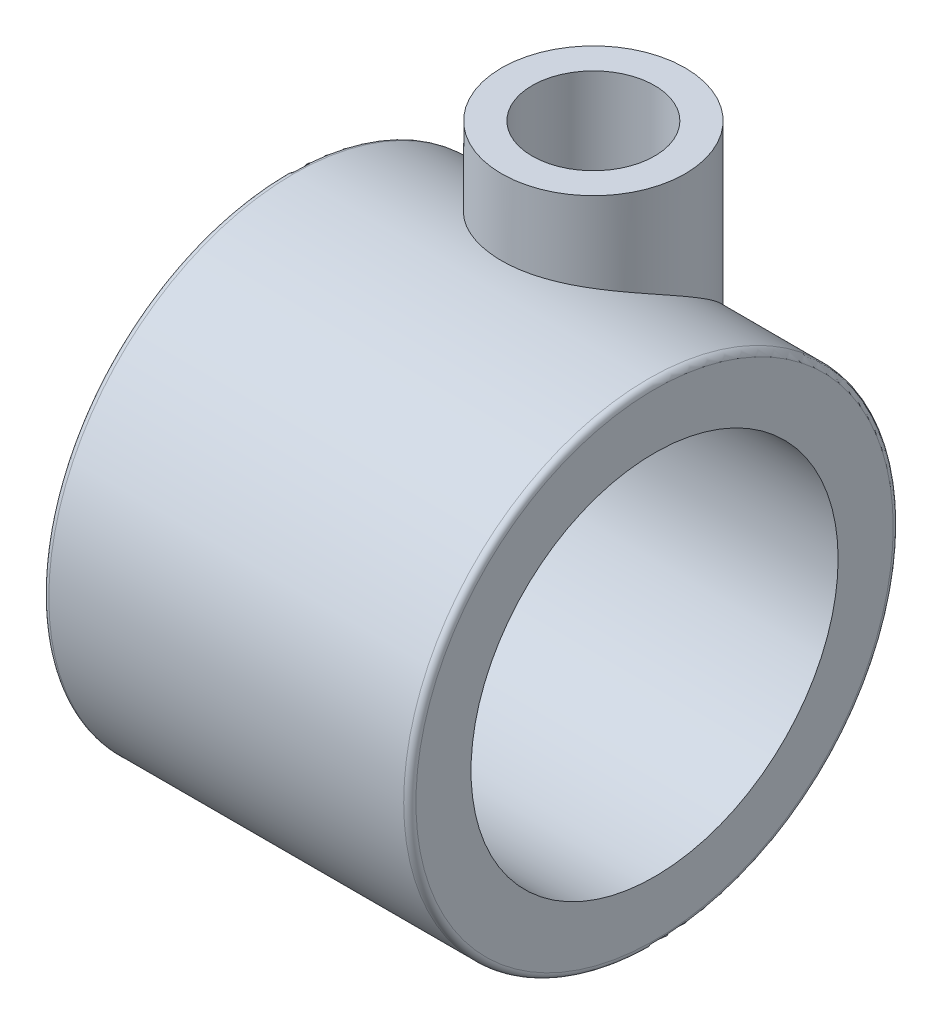
ISO-10303-21;
HEADER;
FILE_DESCRIPTION(('STEP AP214'),'2;1');
FILE_NAME('part.step','',(''),(''),'','','');
FILE_SCHEMA(('AUTOMOTIVE_DESIGN { 1 0 10303 214 1 1 1 1 }'));
ENDSEC;
DATA;
#1=APPLICATION_CONTEXT('core data for automotive mechanical design processes');
#2=APPLICATION_PROTOCOL_DEFINITION('international standard','automotive_design',2000,#1);
#3=PRODUCT_CONTEXT('',#1,'mechanical');
#4=PRODUCT('Part','Part','',(#3));
#5=PRODUCT_RELATED_PRODUCT_CATEGORY('part','',(#4));
#6=PRODUCT_DEFINITION_FORMATION('','',#4);
#7=PRODUCT_DEFINITION_CONTEXT('part definition',#1,'design');
#8=PRODUCT_DEFINITION('design','',#6,#7);
#9=PRODUCT_DEFINITION_SHAPE('','',#8);
#10=(LENGTH_UNIT() NAMED_UNIT(*) SI_UNIT(.MILLI.,.METRE.));
#11=(NAMED_UNIT(*) PLANE_ANGLE_UNIT() SI_UNIT($,.RADIAN.));
#12=(NAMED_UNIT(*) SI_UNIT($,.STERADIAN.) SOLID_ANGLE_UNIT());
#13=UNCERTAINTY_MEASURE_WITH_UNIT(LENGTH_MEASURE(1.E-05),#10,'distance_accuracy_value','');
#14=(GEOMETRIC_REPRESENTATION_CONTEXT(3) GLOBAL_UNCERTAINTY_ASSIGNED_CONTEXT((#13)) GLOBAL_UNIT_ASSIGNED_CONTEXT((#10,
#11,#12)) REPRESENTATION_CONTEXT('',''));
#15=CARTESIAN_POINT('',(0.,0.,0.));
#16=DIRECTION('',(0.,0.,1.));
#17=DIRECTION('',(1.,0.,0.));
#18=AXIS2_PLACEMENT_3D('',#15,#16,#17);
#19=CARTESIAN_POINT('',(30.,0.,0.));
#20=DIRECTION('',(-1.,0.,0.));
#21=DIRECTION('',(0.,0.,1.));
#22=AXIS2_PLACEMENT_3D('',#19,#20,#21);
#23=CYLINDRICAL_SURFACE('',#22,15.);
#24=CARTESIAN_POINT('',(0.,0.,0.));
#25=DIRECTION('',(1.,0.,0.));
#26=DIRECTION('',(0.,0.,-1.));
#27=AXIS2_PLACEMENT_3D('',#24,#25,#26);
#28=CIRCLE('',#27,15.);
#29=CARTESIAN_POINT('',(0.,0.,-15.));
#30=VERTEX_POINT('',#29);
#31=EDGE_CURVE('E57',#30,#30,#28,.T.);
#32=ORIENTED_EDGE('',*,*,#31,.F.);
#33=EDGE_LOOP('',(#32));
#34=FACE_BOUND('',#33,.T.);
#35=CARTESIAN_POINT('',(30.,0.,0.));
#36=DIRECTION('',(1.,0.,0.));
#37=DIRECTION('',(0.,0.,-1.));
#38=AXIS2_PLACEMENT_3D('',#35,#36,#37);
#39=CIRCLE('',#38,15.);
#40=CARTESIAN_POINT('',(30.,0.,-15.));
#41=VERTEX_POINT('',#40);
#42=EDGE_CURVE('E60',#41,#41,#39,.T.);
#43=ORIENTED_EDGE('',*,*,#42,.T.);
#44=EDGE_LOOP('',(#43));
#45=FACE_BOUND('',#44,.T.);
#46=ADVANCED_FACE('F36',(#34,#45),#23,.F.);
#47=CARTESIAN_POINT('',(30.,0.,0.));
#48=DIRECTION('',(1.,0.,0.));
#49=DIRECTION('',(0.,0.,-1.));
#50=AXIS2_PLACEMENT_3D('',#47,#48,#49);
#51=PLANE('',#50);
#52=CARTESIAN_POINT('',(30.,0.,0.));
#53=DIRECTION('',(1.,0.,0.));
#54=DIRECTION('',(0.,0.,-1.));
#55=AXIS2_PLACEMENT_3D('',#52,#53,#54);
#56=CIRCLE('',#55,19.5);
#57=CARTESIAN_POINT('',(30.,0.,-19.5));
#58=VERTEX_POINT('',#57);
#59=EDGE_CURVE('E51',#58,#58,#56,.T.);
#60=ORIENTED_EDGE('',*,*,#59,.T.);
#61=EDGE_LOOP('',(#60));
#62=FACE_BOUND('',#61,.T.);
#63=ORIENTED_EDGE('',*,*,#42,.F.);
#64=EDGE_LOOP('',(#63));
#65=FACE_BOUND('',#64,.T.);
#66=ADVANCED_FACE('F85',(#62,#65),#51,.T.);
#67=CARTESIAN_POINT('',(0.,0.,0.));
#68=DIRECTION('',(1.,0.,0.));
#69=DIRECTION('',(0.,0.,-1.));
#70=AXIS2_PLACEMENT_3D('',#67,#68,#69);
#71=PLANE('',#70);
#72=CARTESIAN_POINT('',(0.,0.,0.));
#73=DIRECTION('',(1.,0.,0.));
#74=DIRECTION('',(0.,0.,-1.));
#75=AXIS2_PLACEMENT_3D('',#72,#73,#74);
#76=CIRCLE('',#75,19.5);
#77=CARTESIAN_POINT('',(0.,0.,-19.5));
#78=VERTEX_POINT('',#77);
#79=EDGE_CURVE('E10',#78,#78,#76,.F.);
#80=ORIENTED_EDGE('',*,*,#79,.T.);
#81=EDGE_LOOP('',(#80));
#82=FACE_BOUND('',#81,.T.);
#83=ORIENTED_EDGE('',*,*,#31,.T.);
#84=EDGE_LOOP('',(#83));
#85=FACE_BOUND('',#84,.T.);
#86=ADVANCED_FACE('F88',(#82,#85),#71,.F.);
#87=CARTESIAN_POINT('',(30.,0.,0.));
#88=DIRECTION('',(-1.,0.,0.));
#89=DIRECTION('',(0.,0.,1.));
#90=AXIS2_PLACEMENT_3D('',#87,#88,#89);
#91=CYLINDRICAL_SURFACE('',#90,20.);
#92=CARTESIAN_POINT('',(29.5,0.,0.));
#93=DIRECTION('',(1.,0.,0.));
#94=DIRECTION('',(0.,0.,-1.));
#95=AXIS2_PLACEMENT_3D('',#92,#93,#94);
#96=CIRCLE('',#95,20.);
#97=CARTESIAN_POINT('',(29.5,0.,-20.));
#98=VERTEX_POINT('',#97);
#99=EDGE_CURVE('E43',#98,#98,#96,.F.);
#100=ORIENTED_EDGE('',*,*,#99,.T.);
#101=EDGE_LOOP('',(#100));
#102=FACE_BOUND('',#101,.T.);
#103=CARTESIAN_POINT('',(0.5,0.,0.));
#104=DIRECTION('',(1.,0.,0.));
#105=DIRECTION('',(0.,0.,-1.));
#106=AXIS2_PLACEMENT_3D('',#103,#104,#105);
#107=CIRCLE('',#106,20.);
#108=CARTESIAN_POINT('',(0.5,0.,-20.));
#109=VERTEX_POINT('',#108);
#110=EDGE_CURVE('E47',#109,#109,#107,.T.);
#111=ORIENTED_EDGE('',*,*,#110,.T.);
#112=EDGE_LOOP('',(#111));
#113=FACE_BOUND('',#112,.T.);
#114=CARTESIAN_POINT('',(15.,9.68245836551854,-17.5));
#115=CARTESIAN_POINT('',(14.8858939543935,9.68246038812694,-17.4999991516018));
#116=CARTESIAN_POINT('',(14.7717691684201,9.68718254641463,-17.4973887566704));
#117=CARTESIAN_POINT('',(14.5444755456601,9.70588856576061,-17.4870190968777));
#118=CARTESIAN_POINT('',(14.4313072513703,9.71987736672575,-17.4792570857636));
#119=CARTESIAN_POINT('',(14.2066386424844,9.75661871880203,-17.458775203148));
#120=CARTESIAN_POINT('',(14.0951420721052,9.77938855886944,-17.4460455502813));
#121=CARTESIAN_POINT('',(13.8746826816451,9.83291609054082,-17.4159323962588));
#122=CARTESIAN_POINT('',(13.765721385415,9.86367845755435,-17.3985461709512));
#123=CARTESIAN_POINT('',(13.5162712608649,9.94331815944179,-17.3531882346049));
#124=CARTESIAN_POINT('',(13.3769176278018,9.99483940684675,-17.3236105058938));
#125=CARTESIAN_POINT('',(13.1040155443049,10.1081275738057,-17.2577532406532));
#126=CARTESIAN_POINT('',(12.9704722707298,10.1699034031473,-17.2214678729872));
#127=CARTESIAN_POINT('',(12.7091421640422,10.3018362491369,-17.1428723011975));
#128=CARTESIAN_POINT('',(12.5813665334741,10.3720086848123,-17.1005509848069));
#129=CARTESIAN_POINT('',(12.3317270173929,10.5189529413566,-17.0105575040081));
#130=CARTESIAN_POINT('',(12.2098616250625,10.5957230661586,-16.9628867138306));
#131=CARTESIAN_POINT('',(11.8849842143306,10.8123205125167,-16.8261685991519));
#132=CARTESIAN_POINT('',(11.6874818571222,10.9573677007991,-16.7322632432396));
#133=CARTESIAN_POINT('',(11.3074827704613,11.2578720824918,-16.5315778083311));
#134=CARTESIAN_POINT('',(11.1249969589164,11.4133367035658,-16.4247884986579));
#135=CARTESIAN_POINT('',(10.7734159445365,11.731369806005,-16.1991683544922));
#136=CARTESIAN_POINT('',(10.6043494999308,11.893952443834,-16.0803128403736));
#137=CARTESIAN_POINT('',(10.2791462804009,12.223290004439,-15.8314188061957));
#138=CARTESIAN_POINT('',(10.1230074601224,12.3900442617417,-15.7013820618459));
#139=CARTESIAN_POINT('',(9.76996922218353,12.7852590053141,-15.3825348915466));
#140=CARTESIAN_POINT('',(9.57819454644558,13.0146767739294,-15.1892082105508));
#141=CARTESIAN_POINT('',(9.21687050091966,13.4740608656612,-14.783225430442));
#142=CARTESIAN_POINT('',(9.04732926348903,13.7040273583434,-14.5705623065049));
#143=CARTESIAN_POINT('',(8.7313873119802,14.1612592457684,-14.126576968699));
#144=CARTESIAN_POINT('',(8.58496133381431,14.3885273348726,-13.8952755494649));
#145=CARTESIAN_POINT('',(8.31656988346116,14.8379376953426,-13.4143151080641));
#146=CARTESIAN_POINT('',(8.19459565716006,15.0600817758879,-13.1646626997471));
#147=CARTESIAN_POINT('',(8.00067500400602,15.4498071867547,-12.703308597928));
#148=CARTESIAN_POINT('',(7.92361074473863,15.6188528333898,-12.4949844042021));
#149=CARTESIAN_POINT('',(7.78726960110981,15.951046497764,-12.0680255136493));
#150=CARTESIAN_POINT('',(7.72799183315949,16.114194808114,-11.8493913296219));
#151=CARTESIAN_POINT('',(7.62884180394637,16.4331391192928,-11.4029430547488));
#152=CARTESIAN_POINT('',(7.58894633090526,16.5889437117646,-11.1751402999297));
#153=CARTESIAN_POINT('',(7.53015420099777,16.8921212650488,-10.7113461251764));
#154=CARTESIAN_POINT('',(7.51125393348415,17.0394956715051,-10.4753561204443));
#155=CARTESIAN_POINT('',(7.49747506408647,17.3000841376729,-10.0379450815455));
#156=CARTESIAN_POINT('',(7.49903129158898,17.4148208174169,-9.83754004877095));
#157=CARTESIAN_POINT('',(7.51869142381551,17.6369496468421,-9.43351045013628));
#158=CARTESIAN_POINT('',(7.53679222624174,17.7443431693919,-9.22988649489518));
#159=CARTESIAN_POINT('',(7.59039332394134,17.9511566762222,-8.82091101585296));
#160=CARTESIAN_POINT('',(7.62589049091678,18.0505780903466,-8.61555980917736));
#161=CARTESIAN_POINT('',(7.71498078600245,18.2409445318677,-8.20482620783444));
#162=CARTESIAN_POINT('',(7.76857416982703,18.3318894394612,-7.9994438127674));
#163=CARTESIAN_POINT('',(7.89468285787471,18.5054040998947,-7.58945628487349));
#164=CARTESIAN_POINT('',(7.96730370363596,18.5879234535297,-7.38486215807781));
#165=CARTESIAN_POINT('',(8.13150757955118,18.7437825925948,-6.97980712758536));
#166=CARTESIAN_POINT('',(8.22309087605016,18.8171222490645,-6.77934628198782));
#167=CARTESIAN_POINT('',(8.42504450741392,18.9545995945857,-6.38488666050591));
#168=CARTESIAN_POINT('',(8.53541062414879,19.0187393437488,-6.1908864454035));
#169=CARTESIAN_POINT('',(8.77444218343433,19.1380455163196,-5.81160367731215));
#170=CARTESIAN_POINT('',(8.90310597245034,19.1932127495963,-5.62632033860279));
#171=CARTESIAN_POINT('',(9.16434041017945,19.2899796834131,-5.28441906238883));
#172=CARTESIAN_POINT('',(9.29527650013893,19.3323806691246,-5.12677562476098));
#173=CARTESIAN_POINT('',(9.57051668472078,19.4106724757652,-4.82188423582637));
#174=CARTESIAN_POINT('',(9.71482040416153,19.4465634793227,-4.67463599296789));
#175=CARTESIAN_POINT('',(10.0157875300096,19.5123514893739,-4.39194795357273));
#176=CARTESIAN_POINT('',(10.1724493643612,19.5422492565495,-4.25650665969274));
#177=CARTESIAN_POINT('',(10.4970283829695,19.5966367155377,-3.99864959965081));
#178=CARTESIAN_POINT('',(10.6649456371116,19.621126373767,-3.87623391437758));
#179=CARTESIAN_POINT('',(11.0066606928003,19.6647715614609,-3.64827477567391));
#180=CARTESIAN_POINT('',(11.1802216399173,19.6840407055627,-3.54239768946963));
#181=CARTESIAN_POINT('',(11.5357359461336,19.7185608165533,-3.34490899007364));
#182=CARTESIAN_POINT('',(11.7176921015981,19.7338104330544,-3.25330217529352));
#183=CARTESIAN_POINT('',(12.0886399792091,19.760800555958,-3.08512845265193));
#184=CARTESIAN_POINT('',(12.2776305687134,19.7725416245606,-3.00855913589775));
#185=CARTESIAN_POINT('',(12.6613701762945,19.7929806097919,-2.87101995886357));
#186=CARTESIAN_POINT('',(12.8561193929489,19.8016784213456,-2.8100506372274));
#187=CARTESIAN_POINT('',(13.2529399652763,19.8165250280709,-2.7033835186996));
#188=CARTESIAN_POINT('',(13.4550769575194,19.8226343237748,-2.65792429715959));
#189=CARTESIAN_POINT('',(13.8624799931997,19.8324226569449,-2.58387461708936));
#190=CARTESIAN_POINT('',(14.067746128465,19.8361016229494,-2.55528465458741));
#191=CARTESIAN_POINT('',(14.4799784997704,19.8412262135373,-2.51518433319852));
#192=CARTESIAN_POINT('',(14.6869448244769,19.8426717208908,-2.50367487083391));
#193=CARTESIAN_POINT('',(15.1011242153752,19.8434092829264,-2.49782236161838));
#194=CARTESIAN_POINT('',(15.3083372827093,19.8427013276009,-2.50347939454346));
#195=CARTESIAN_POINT('',(15.7234755657961,19.8390758355117,-2.53205048840759));
#196=CARTESIAN_POINT('',(15.9313896914947,19.8361379574979,-2.55512340542565));
#197=CARTESIAN_POINT('',(16.344515696356,19.8278659530847,-2.61854007250795));
#198=CARTESIAN_POINT('',(16.5497276167025,19.8225318632492,-2.65888355904013));
#199=CARTESIAN_POINT('',(16.9559961764262,19.8091877447134,-2.7565389466913));
#200=CARTESIAN_POINT('',(17.1570526195646,19.8011775899436,-2.81385164721665));
#201=CARTESIAN_POINT('',(17.5535471519208,19.7820967165426,-2.94500198765641));
#202=CARTESIAN_POINT('',(17.7489854104076,19.7710260902266,-3.01883912911946));
#203=CARTESIAN_POINT('',(18.1325327935061,19.7453693185424,-3.18232962599733));
#204=CARTESIAN_POINT('',(18.3206528399103,19.7307886652886,-3.27195821447505));
#205=CARTESIAN_POINT('',(18.6884409327914,19.6975675172319,-3.46634489210618));
#206=CARTESIAN_POINT('',(18.8681122186524,19.678928594122,-3.57109711887721));
#207=CARTESIAN_POINT('',(19.2177753897356,19.6370009440232,-3.79488445527837));
#208=CARTESIAN_POINT('',(19.3877666274116,19.6137119064338,-3.91392051877365));
#209=CARTESIAN_POINT('',(19.716812125733,19.5618840993189,-4.16523027792495));
#210=CARTESIAN_POINT('',(19.8758665390426,19.5333454030925,-4.29750378873962));
#211=CARTESIAN_POINT('',(20.1798626868116,19.4708520743267,-4.5722528527043));
#212=CARTESIAN_POINT('',(20.3249637600195,19.4369743815754,-4.71456963269669));
#213=CARTESIAN_POINT('',(20.602427610999,19.3630254089505,-5.00962782810271));
#214=CARTESIAN_POINT('',(20.7347905484097,19.3229542067129,-5.16236911283157));
#215=CARTESIAN_POINT('',(20.9859308918476,19.2361893389928,-5.4768248897654));
#216=CARTESIAN_POINT('',(21.1047106961623,19.189496845861,-5.63853779039755));
#217=CARTESIAN_POINT('',(21.3280650589188,19.089151525466,-5.96943700563971));
#218=CARTESIAN_POINT('',(21.4326396718233,19.0354987248901,-6.13862329159355));
#219=CARTESIAN_POINT('',(21.6262603480668,18.9215408973456,-6.48132701952749));
#220=CARTESIAN_POINT('',(21.7154380491463,18.8613002824997,-6.65479158694737));
#221=CARTESIAN_POINT('',(21.8791807034536,18.733705357282,-7.00593866239477));
#222=CARTESIAN_POINT('',(21.9537458237902,18.6663511282748,-7.18362112216057));
#223=CARTESIAN_POINT('',(22.0882476518235,18.5245809095832,-7.54168275094733));
#224=CARTESIAN_POINT('',(22.1481838209085,18.4501646600279,-7.72206201900052));
#225=CARTESIAN_POINT('',(22.2536040063939,18.2944418892915,-8.08407253494707));
#226=CARTESIAN_POINT('',(22.2990866028284,18.2131346921148,-8.26570390406112));
#227=CARTESIAN_POINT('',(22.3776721963574,18.0400911078825,-8.63706807165621));
#228=CARTESIAN_POINT('',(22.4101233757927,17.9480495592312,-8.8267963087451));
#229=CARTESIAN_POINT('',(22.4601582745921,17.7571678077146,-9.2047719197702));
#230=CARTESIAN_POINT('',(22.4777416269853,17.6583274371044,-9.39301925704089));
#231=CARTESIAN_POINT('',(22.4987156796924,17.4543096941327,-9.76690542169621));
#232=CARTESIAN_POINT('',(22.5021022992632,17.3491305085382,-9.95254348378439));
#233=CARTESIAN_POINT('',(22.4954182082971,17.1329901223932,-10.3201809704512));
#234=CARTESIAN_POINT('',(22.4853459000324,17.0220282368731,-10.5021799604273));
#235=CARTESIAN_POINT('',(22.4502967667633,16.7795185486176,-10.8860471565714));
#236=CARTESIAN_POINT('',(22.4234877693352,16.647216730858,-11.0872720359592));
#237=CARTESIAN_POINT('',(22.3546546631353,16.3767290438713,-11.4830404446211));
#238=CARTESIAN_POINT('',(22.3126293428193,16.238542706884,-11.6775834405238));
#239=CARTESIAN_POINT('',(22.2144299820545,15.9570902196038,-12.0593333867687));
#240=CARTESIAN_POINT('',(22.158252758695,15.8138229327888,-12.2465386758236));
#241=CARTESIAN_POINT('',(22.0327338642658,15.5230456686778,-12.6130805139087));
#242=CARTESIAN_POINT('',(21.9633906682336,15.3755352015921,-12.7924161484627));
#243=CARTESIAN_POINT('',(21.7966792942349,15.0459928796708,-13.1793554187971));
#244=CARTESIAN_POINT('',(21.6964821803324,14.8631687639637,-13.3850691599229));
#245=CARTESIAN_POINT('',(21.4793807021217,14.4939014286627,-13.7840756501963));
#246=CARTESIAN_POINT('',(21.3624736445754,14.3074576298579,-13.9773663897625));
#247=CARTESIAN_POINT('',(21.1126759947502,13.9321103392878,-14.351537598008));
#248=CARTESIAN_POINT('',(20.9797597624926,13.7432033457676,-14.5323974101084));
#249=CARTESIAN_POINT('',(20.6986624306199,13.3648128181863,-14.8811277043718));
#250=CARTESIAN_POINT('',(20.5504829800652,13.1753293485508,-15.048999586345));
#251=CARTESIAN_POINT('',(20.2427692580727,12.8021600581656,-15.3676090519079));
#252=CARTESIAN_POINT('',(20.0835989190574,12.6184453368489,-15.5186641196526));
#253=CARTESIAN_POINT('',(19.750466555612,12.2541520292484,-15.8079044805469));
#254=CARTESIAN_POINT('',(19.5765002422266,12.0735743707076,-15.9460860175165));
#255=CARTESIAN_POINT('',(19.2134093699278,11.7187198734998,-16.2086451273464));
#256=CARTESIAN_POINT('',(19.0243215163891,11.5444291832629,-16.3330544774856));
#257=CARTESIAN_POINT('',(18.6293804491014,11.2055672629019,-16.5673659119895));
#258=CARTESIAN_POINT('',(18.4235410587644,11.040988208372,-16.6772797656634));
#259=CARTESIAN_POINT('',(17.994408093068,10.7278883489367,-16.8803723475433));
#260=CARTESIAN_POINT('',(17.7712352861499,10.5792710748329,-16.9736541592829));
#261=CARTESIAN_POINT('',(17.3044252839563,10.305077902567,-17.1415032916371));
#262=CARTESIAN_POINT('',(17.0608067071312,10.1794813660119,-17.2160873972729));
#263=CARTESIAN_POINT('',(16.5994967717697,9.98311772229848,-17.3305487576377));
#264=CARTESIAN_POINT('',(16.3853525409974,9.90650495618506,-17.3742947821441));
#265=CARTESIAN_POINT('',(16.0558527172933,9.8148295216778,-17.426139535047));
#266=CARTESIAN_POINT('',(15.9447481432319,9.78815930881533,-17.4411177075068));
#267=CARTESIAN_POINT('',(15.7203099748603,9.74336480814035,-17.4661818969327));
#268=CARTESIAN_POINT('',(15.6069777216696,9.72523553326613,-17.4762707688649));
#269=CARTESIAN_POINT('',(15.4112866899997,9.70202684329158,-17.4891621574117));
#270=CARTESIAN_POINT('',(15.329269157543,9.69470376787819,-17.4932201210473));
#271=CARTESIAN_POINT('',(15.1648377264609,9.68491831602546,-17.498639616398));
#272=CARTESIAN_POINT('',(15.082423752405,9.68245690450065,-17.5000006128349));
#273=CARTESIAN_POINT('',(15.,9.68245836551854,-17.5));
#274=B_SPLINE_CURVE_WITH_KNOTS('',3,(#114,#115,#116,#117,#118,#119,#120,#121,#122,#123,#124,
#125,#126,#127,#128,#129,#130,#131,#132,#133,#134,#135,#136,#137,#138,#139,#140,#141,#142,#143,
#144,#145,#146,#147,#148,#149,#150,#151,#152,#153,#154,#155,#156,#157,#158,#159,#160,#161,#162,
#163,#164,#165,#166,#167,#168,#169,#170,#171,#172,#173,#174,#175,#176,#177,#178,#179,#180,#181,
#182,#183,#184,#185,#186,#187,#188,#189,#190,#191,#192,#193,#194,#195,#196,#197,#198,#199,#200,
#201,#202,#203,#204,#205,#206,#207,#208,#209,#210,#211,#212,#213,#214,#215,#216,#217,#218,#219,
#220,#221,#222,#223,#224,#225,#226,#227,#228,#229,#230,#231,#232,#233,#234,#235,#236,#237,#238,
#239,#240,#241,#242,#243,#244,#245,#246,#247,#248,#249,#250,#251,#252,#253,#254,#255,#256,#257,
#258,#259,#260,#261,#262,#263,#264,#265,#266,#267,#268,#269,#270,#271,#272,#273),.UNSPECIFIED.,
.T.,.F.,(4,2,2,2,2,2,2,2,2,2,2,2,2,2,2,2,2,2,2,2,2,2,2,2,2,2,2,2,2,2,2,2,2,2,2,2,2,2,2,2,2,2,2,
2,2,2,2,2,2,2,2,2,2,2,2,2,2,2,2,2,2,2,2,2,2,2,2,2,2,2,2,2,2,2,2,2,2,2,2,4),(0.,
0.342225736442231,0.684634055212437,1.02772001109615,1.37100711652116,1.82473947849137,
2.27886815351237,2.73384394473275,3.18870312327139,3.97468890382119,4.76124118375988,
5.5494359541854,6.33750578049215,7.40440886062583,8.47170110142348,9.53781863366997,
10.6035537946292,11.4402062600936,12.2768171558487,13.1124236611938,13.9478864409804,
14.6400028342626,15.3319894743917,16.0238517237903,16.7157237501781,17.4115178302939,
18.1073216841389,18.8029694843467,19.4985544597509,20.1255909185381,20.75260978398,
21.3795490155984,22.0064921402676,22.6184335984536,23.2305803812613,23.842629022684,
24.4546987943539,25.0757985931697,25.6969166540624,26.3180673150851,26.9392208627185,
27.5661096728546,28.1929889176198,28.8198976988743,29.446787572292,30.0727028591665,
30.6983761704212,31.3240912870016,31.9497976676156,32.5671963787634,33.1845873514325,
33.8018691464443,34.4191485747382,35.030856592436,35.6425576142562,36.2542811544126,
36.8660647737086,37.5054764144105,38.1449038367505,38.7845150450552,39.4242021892323,
40.1504377376927,40.8767311227319,41.6031880048014,42.3297290808841,43.2075608626134,
44.085534289448,44.964933041331,45.8442368811492,46.7021493914516,47.5603114406892,
48.4164502150115,49.2718895290416,50.1218271927752,50.9709991089187,51.6629973149389,
52.0083420144123,52.3534848161001,52.6006402794702,52.8478447918799),.UNSPECIFIED.);
#275=CARTESIAN_POINT('',(15.,9.68245836551854,-17.5));
#276=VERTEX_POINT('',#275);
#277=EDGE_CURVE('E56',#276,#276,#274,.T.);
#278=ORIENTED_EDGE('',*,*,#277,.F.);
#279=EDGE_LOOP('',(#278));
#280=FACE_BOUND('',#279,.T.);
#281=ADVANCED_FACE('F72',(#102,#113,#280),#91,.T.);
#282=CARTESIAN_POINT('',(15.,26.,-10.));
#283=DIRECTION('',(0.,-1.,0.));
#284=DIRECTION('',(0.,0.,-1.));
#285=AXIS2_PLACEMENT_3D('',#282,#283,#284);
#286=CYLINDRICAL_SURFACE('',#285,7.5);
#287=CARTESIAN_POINT('',(15.,26.,-10.));
#288=DIRECTION('',(0.,1.,0.));
#289=DIRECTION('',(0.,0.,1.));
#290=AXIS2_PLACEMENT_3D('',#287,#288,#289);
#291=CIRCLE('',#290,7.5);
#292=CARTESIAN_POINT('',(15.,26.,-2.5));
#293=VERTEX_POINT('',#292);
#294=EDGE_CURVE('E61',#293,#293,#291,.T.);
#295=ORIENTED_EDGE('',*,*,#294,.F.);
#296=EDGE_LOOP('',(#295));
#297=FACE_BOUND('',#296,.T.);
#298=ORIENTED_EDGE('',*,*,#277,.T.);
#299=EDGE_LOOP('',(#298));
#300=FACE_BOUND('',#299,.T.);
#301=ADVANCED_FACE('F75',(#297,#300),#286,.T.);
#302=CARTESIAN_POINT('',(15.,26.,-10.));
#303=DIRECTION('',(0.,1.,0.));
#304=DIRECTION('',(0.,0.,1.));
#305=AXIS2_PLACEMENT_3D('',#302,#303,#304);
#306=PLANE('',#305);
#307=CARTESIAN_POINT('',(15.,26.,-10.));
#308=DIRECTION('',(0.,1.,0.));
#309=DIRECTION('',(0.,0.,1.));
#310=AXIS2_PLACEMENT_3D('',#307,#308,#309);
#311=CIRCLE('',#310,5.);
#312=CARTESIAN_POINT('',(15.,26.,-5.));
#313=VERTEX_POINT('',#312);
#314=EDGE_CURVE('E130',#313,#313,#311,.T.);
#315=ORIENTED_EDGE('',*,*,#314,.F.);
#316=EDGE_LOOP('',(#315));
#317=FACE_BOUND('',#316,.T.);
#318=ORIENTED_EDGE('',*,*,#294,.T.);
#319=EDGE_LOOP('',(#318));
#320=FACE_BOUND('',#319,.T.);
#321=ADVANCED_FACE('F80',(#317,#320),#306,.T.);
#322=CARTESIAN_POINT('',(15.,16.,-10.));
#323=DIRECTION('',(0.,1.,0.));
#324=DIRECTION('',(0.,0.,1.));
#325=AXIS2_PLACEMENT_3D('',#322,#323,#324);
#326=CYLINDRICAL_SURFACE('',#325,5.);
#327=CARTESIAN_POINT('',(15.,16.,-10.));
#328=DIRECTION('',(0.,1.,0.));
#329=DIRECTION('',(0.,0.,1.));
#330=AXIS2_PLACEMENT_3D('',#327,#328,#329);
#331=CIRCLE('',#330,5.);
#332=CARTESIAN_POINT('',(15.,16.,-5.));
#333=VERTEX_POINT('',#332);
#334=EDGE_CURVE('E129',#333,#333,#331,.T.);
#335=ORIENTED_EDGE('',*,*,#334,.F.);
#336=EDGE_LOOP('',(#335));
#337=FACE_BOUND('',#336,.T.);
#338=ORIENTED_EDGE('',*,*,#314,.T.);
#339=EDGE_LOOP('',(#338));
#340=FACE_BOUND('',#339,.T.);
#341=ADVANCED_FACE('F118',(#337,#340),#326,.F.);
#342=CARTESIAN_POINT('',(15.,16.,-10.));
#343=DIRECTION('',(0.,1.,0.));
#344=DIRECTION('',(0.,0.,1.));
#345=AXIS2_PLACEMENT_3D('',#342,#343,#344);
#346=PLANE('',#345);
#347=ORIENTED_EDGE('',*,*,#334,.T.);
#348=EDGE_LOOP('',(#347));
#349=FACE_BOUND('',#348,.T.);
#350=ADVANCED_FACE('F113',(#349),#346,.T.);
#351=CARTESIAN_POINT('',(29.5,0.,0.));
#352=DIRECTION('',(1.,0.,0.));
#353=DIRECTION('',(0.,0.,-1.));
#354=AXIS2_PLACEMENT_3D('',#351,#352,#353);
#355=TOROIDAL_SURFACE('',#354,19.5,0.5);
#356=ORIENTED_EDGE('',*,*,#99,.F.);
#357=EDGE_LOOP('',(#356));
#358=FACE_BOUND('',#357,.T.);
#359=ORIENTED_EDGE('',*,*,#59,.F.);
#360=EDGE_LOOP('',(#359));
#361=FACE_BOUND('',#360,.T.);
#362=ADVANCED_FACE('F108',(#358,#361),#355,.T.);
#363=CARTESIAN_POINT('',(0.5,0.,0.));
#364=DIRECTION('',(1.,0.,0.));
#365=DIRECTION('',(0.,0.,-1.));
#366=AXIS2_PLACEMENT_3D('',#363,#364,#365);
#367=TOROIDAL_SURFACE('',#366,19.5,0.5);
#368=ORIENTED_EDGE('',*,*,#79,.F.);
#369=EDGE_LOOP('',(#368));
#370=FACE_BOUND('',#369,.T.);
#371=ORIENTED_EDGE('',*,*,#110,.F.);
#372=EDGE_LOOP('',(#371));
#373=FACE_BOUND('',#372,.T.);
#374=ADVANCED_FACE('F38',(#370,#373),#367,.T.);
#375=CLOSED_SHELL('',(#46,#66,#86,#281,#301,#321,#341,#350,#362,#374));
#376=MANIFOLD_SOLID_BREP('B2',#375);
#377=ADVANCED_BREP_SHAPE_REPRESENTATION('',(#18,#376),#14);
#378=SHAPE_DEFINITION_REPRESENTATION(#9,#377);
ENDSEC;
END-ISO-10303-21;
